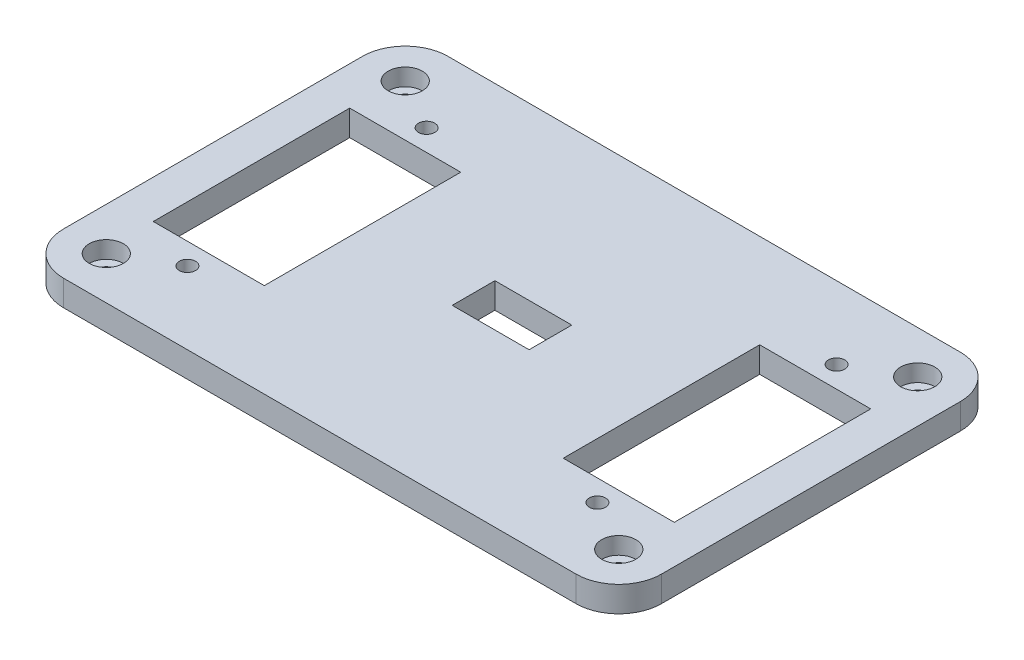
ISO-10303-21;
HEADER;
FILE_DESCRIPTION(('STEP AP214'),'2;1');
FILE_NAME('part.step','',(''),(''),'','','');
FILE_SCHEMA(('AUTOMOTIVE_DESIGN { 1 0 10303 214 1 1 1 1 }'));
ENDSEC;
DATA;
#1=APPLICATION_CONTEXT('core data for automotive mechanical design processes');
#2=APPLICATION_PROTOCOL_DEFINITION('international standard','automotive_design',2000,#1);
#3=PRODUCT_CONTEXT('',#1,'mechanical');
#4=PRODUCT('Part','Part','',(#3));
#5=PRODUCT_RELATED_PRODUCT_CATEGORY('part','',(#4));
#6=PRODUCT_DEFINITION_FORMATION('','',#4);
#7=PRODUCT_DEFINITION_CONTEXT('part definition',#1,'design');
#8=PRODUCT_DEFINITION('design','',#6,#7);
#9=PRODUCT_DEFINITION_SHAPE('','',#8);
#10=(LENGTH_UNIT() NAMED_UNIT(*) SI_UNIT(.MILLI.,.METRE.));
#11=(NAMED_UNIT(*) PLANE_ANGLE_UNIT() SI_UNIT($,.RADIAN.));
#12=(NAMED_UNIT(*) SI_UNIT($,.STERADIAN.) SOLID_ANGLE_UNIT());
#13=UNCERTAINTY_MEASURE_WITH_UNIT(LENGTH_MEASURE(1.E-05),#10,'distance_accuracy_value','');
#14=(GEOMETRIC_REPRESENTATION_CONTEXT(3) GLOBAL_UNCERTAINTY_ASSIGNED_CONTEXT((#13)) GLOBAL_UNIT_ASSIGNED_CONTEXT((#10,
#11,#12)) REPRESENTATION_CONTEXT('',''));
#15=CARTESIAN_POINT('',(0.,0.,0.));
#16=DIRECTION('',(0.,0.,1.));
#17=DIRECTION('',(1.,0.,0.));
#18=AXIS2_PLACEMENT_3D('',#15,#16,#17);
#19=CARTESIAN_POINT('',(30.,-7.,17.5));
#20=DIRECTION('',(0.,1.,0.));
#21=DIRECTION('',(0.,0.,1.));
#22=AXIS2_PLACEMENT_3D('',#19,#20,#21);
#23=CYLINDRICAL_SURFACE('',#22,0.950000000000001);
#24=CARTESIAN_POINT('',(30.,0.,17.5));
#25=DIRECTION('',(0.,1.,0.));
#26=DIRECTION('',(0.,0.,1.));
#27=AXIS2_PLACEMENT_3D('',#24,#25,#26);
#28=CIRCLE('',#27,0.950000000000001);
#29=CARTESIAN_POINT('',(30.,0.,18.45));
#30=VERTEX_POINT('',#29);
#31=EDGE_CURVE('E385',#30,#30,#28,.T.);
#32=ORIENTED_EDGE('',*,*,#31,.F.);
#33=EDGE_LOOP('',(#32));
#34=FACE_BOUND('',#33,.T.);
#35=CARTESIAN_POINT('',(30.,1.,17.5));
#36=DIRECTION('',(0.,1.,0.));
#37=DIRECTION('',(0.,0.,1.));
#38=AXIS2_PLACEMENT_3D('',#35,#36,#37);
#39=CIRCLE('',#38,0.950000000000001);
#40=CARTESIAN_POINT('',(30.,1.,18.45));
#41=VERTEX_POINT('',#40);
#42=EDGE_CURVE('E203',#41,#41,#39,.F.);
#43=ORIENTED_EDGE('',*,*,#42,.F.);
#44=EDGE_LOOP('',(#43));
#45=FACE_BOUND('',#44,.T.);
#46=ADVANCED_FACE('F34',(#34,#45),#23,.F.);
#47=CARTESIAN_POINT('',(-30.,-7.,17.5));
#48=DIRECTION('',(0.,1.,0.));
#49=DIRECTION('',(0.,0.,1.));
#50=AXIS2_PLACEMENT_3D('',#47,#48,#49);
#51=CYLINDRICAL_SURFACE('',#50,0.950000000000001);
#52=CARTESIAN_POINT('',(-30.,0.,17.5));
#53=DIRECTION('',(0.,1.,0.));
#54=DIRECTION('',(0.,0.,1.));
#55=AXIS2_PLACEMENT_3D('',#52,#53,#54);
#56=CIRCLE('',#55,0.950000000000001);
#57=CARTESIAN_POINT('',(-30.,0.,18.45));
#58=VERTEX_POINT('',#57);
#59=EDGE_CURVE('E382',#58,#58,#56,.T.);
#60=ORIENTED_EDGE('',*,*,#59,.F.);
#61=EDGE_LOOP('',(#60));
#62=FACE_BOUND('',#61,.T.);
#63=CARTESIAN_POINT('',(-30.,1.,17.5));
#64=DIRECTION('',(0.,1.,0.));
#65=DIRECTION('',(0.,0.,1.));
#66=AXIS2_PLACEMENT_3D('',#63,#64,#65);
#67=CIRCLE('',#66,0.950000000000001);
#68=CARTESIAN_POINT('',(-30.,1.,18.45));
#69=VERTEX_POINT('',#68);
#70=EDGE_CURVE('E209',#69,#69,#67,.F.);
#71=ORIENTED_EDGE('',*,*,#70,.F.);
#72=EDGE_LOOP('',(#71));
#73=FACE_BOUND('',#72,.T.);
#74=ADVANCED_FACE('F419',(#62,#73),#51,.F.);
#75=CARTESIAN_POINT('',(30.,-7.,-17.5));
#76=DIRECTION('',(0.,1.,0.));
#77=DIRECTION('',(0.,0.,1.));
#78=AXIS2_PLACEMENT_3D('',#75,#76,#77);
#79=CYLINDRICAL_SURFACE('',#78,0.950000000000001);
#80=CARTESIAN_POINT('',(30.,0.,-17.5));
#81=DIRECTION('',(0.,1.,0.));
#82=DIRECTION('',(0.,0.,1.));
#83=AXIS2_PLACEMENT_3D('',#80,#81,#82);
#84=CIRCLE('',#83,0.950000000000001);
#85=CARTESIAN_POINT('',(30.,0.,-16.55));
#86=VERTEX_POINT('',#85);
#87=EDGE_CURVE('E379',#86,#86,#84,.T.);
#88=ORIENTED_EDGE('',*,*,#87,.F.);
#89=EDGE_LOOP('',(#88));
#90=FACE_BOUND('',#89,.T.);
#91=CARTESIAN_POINT('',(30.,1.,-17.5));
#92=DIRECTION('',(0.,1.,0.));
#93=DIRECTION('',(0.,0.,1.));
#94=AXIS2_PLACEMENT_3D('',#91,#92,#93);
#95=CIRCLE('',#94,0.950000000000001);
#96=CARTESIAN_POINT('',(30.,1.,-16.55));
#97=VERTEX_POINT('',#96);
#98=EDGE_CURVE('E216',#97,#97,#95,.F.);
#99=ORIENTED_EDGE('',*,*,#98,.F.);
#100=EDGE_LOOP('',(#99));
#101=FACE_BOUND('',#100,.T.);
#102=ADVANCED_FACE('F425',(#90,#101),#79,.F.);
#103=CARTESIAN_POINT('',(-30.,-7.,-17.5));
#104=DIRECTION('',(0.,1.,0.));
#105=DIRECTION('',(0.,0.,1.));
#106=AXIS2_PLACEMENT_3D('',#103,#104,#105);
#107=CYLINDRICAL_SURFACE('',#106,0.950000000000001);
#108=CARTESIAN_POINT('',(-30.,0.,-17.5));
#109=DIRECTION('',(0.,1.,0.));
#110=DIRECTION('',(0.,0.,1.));
#111=AXIS2_PLACEMENT_3D('',#108,#109,#110);
#112=CIRCLE('',#111,0.950000000000001);
#113=CARTESIAN_POINT('',(-30.,0.,-16.55));
#114=VERTEX_POINT('',#113);
#115=EDGE_CURVE('E231',#114,#114,#112,.T.);
#116=ORIENTED_EDGE('',*,*,#115,.F.);
#117=EDGE_LOOP('',(#116));
#118=FACE_BOUND('',#117,.T.);
#119=CARTESIAN_POINT('',(-30.,1.,-17.5));
#120=DIRECTION('',(0.,1.,0.));
#121=DIRECTION('',(0.,0.,1.));
#122=AXIS2_PLACEMENT_3D('',#119,#120,#121);
#123=CIRCLE('',#122,0.950000000000001);
#124=CARTESIAN_POINT('',(-30.,1.,-16.55));
#125=VERTEX_POINT('',#124);
#126=EDGE_CURVE('E223',#125,#125,#123,.F.);
#127=ORIENTED_EDGE('',*,*,#126,.F.);
#128=EDGE_LOOP('',(#127));
#129=FACE_BOUND('',#128,.T.);
#130=ADVANCED_FACE('F436',(#118,#129),#107,.F.);
#131=CARTESIAN_POINT('',(35.,3.,-22.5));
#132=DIRECTION('',(-1.,0.,0.));
#133=DIRECTION('',(0.,0.,1.));
#134=AXIS2_PLACEMENT_3D('',#131,#132,#133);
#135=PLANE('',#134);
#136=DIRECTION('',(0.,0.,-1.));
#137=VECTOR('',#136,1.);
#138=CARTESIAN_POINT('',(35.,3.,-22.5));
#139=LINE('',#138,#137);
#140=CARTESIAN_POINT('',(35.,3.,17.5));
#141=VERTEX_POINT('',#140);
#142=CARTESIAN_POINT('',(35.,3.,-17.5));
#143=VERTEX_POINT('',#142);
#144=EDGE_CURVE('E285',#141,#143,#139,.T.);
#145=ORIENTED_EDGE('',*,*,#144,.F.);
#146=DIRECTION('',(0.,-1.,0.));
#147=VECTOR('',#146,1.);
#148=CARTESIAN_POINT('',(35.,3.,17.5));
#149=LINE('',#148,#147);
#150=CARTESIAN_POINT('',(35.,0.,17.5));
#151=VERTEX_POINT('',#150);
#152=EDGE_CURVE('E373',#141,#151,#149,.T.);
#153=ORIENTED_EDGE('',*,*,#152,.T.);
#154=DIRECTION('',(0.,0.,-1.));
#155=VECTOR('',#154,1.);
#156=CARTESIAN_POINT('',(35.,0.,-22.5));
#157=LINE('',#156,#155);
#158=CARTESIAN_POINT('',(35.,0.,-17.5));
#159=VERTEX_POINT('',#158);
#160=EDGE_CURVE('E278',#151,#159,#157,.T.);
#161=ORIENTED_EDGE('',*,*,#160,.T.);
#162=DIRECTION('',(0.,-1.,0.));
#163=VECTOR('',#162,1.);
#164=CARTESIAN_POINT('',(35.,3.,-17.5));
#165=LINE('',#164,#163);
#166=EDGE_CURVE('E344',#159,#143,#165,.F.);
#167=ORIENTED_EDGE('',*,*,#166,.T.);
#168=EDGE_LOOP('',(#145,#153,#161,#167));
#169=FACE_BOUND('',#168,.T.);
#170=ADVANCED_FACE('F440',(#169),#135,.F.);
#171=CARTESIAN_POINT('',(-35.,3.,-22.5));
#172=DIRECTION('',(0.,0.,1.));
#173=DIRECTION('',(1.,0.,0.));
#174=AXIS2_PLACEMENT_3D('',#171,#172,#173);
#175=PLANE('',#174);
#176=DIRECTION('',(-1.,0.,0.));
#177=VECTOR('',#176,1.);
#178=CARTESIAN_POINT('',(-35.,0.,-22.5));
#179=LINE('',#178,#177);
#180=CARTESIAN_POINT('',(30.,0.,-22.5));
#181=VERTEX_POINT('',#180);
#182=CARTESIAN_POINT('',(-30.,0.,-22.5));
#183=VERTEX_POINT('',#182);
#184=EDGE_CURVE('E299',#181,#183,#179,.T.);
#185=ORIENTED_EDGE('',*,*,#184,.T.);
#186=DIRECTION('',(0.,-1.,0.));
#187=VECTOR('',#186,1.);
#188=CARTESIAN_POINT('',(-30.,3.,-22.5));
#189=LINE('',#188,#187);
#190=CARTESIAN_POINT('',(-30.,3.,-22.5));
#191=VERTEX_POINT('',#190);
#192=EDGE_CURVE('E360',#183,#191,#189,.F.);
#193=ORIENTED_EDGE('',*,*,#192,.T.);
#194=DIRECTION('',(-1.,0.,0.));
#195=VECTOR('',#194,1.);
#196=CARTESIAN_POINT('',(-35.,3.,-22.5));
#197=LINE('',#196,#195);
#198=CARTESIAN_POINT('',(30.,3.,-22.5));
#199=VERTEX_POINT('',#198);
#200=EDGE_CURVE('E287',#199,#191,#197,.T.);
#201=ORIENTED_EDGE('',*,*,#200,.F.);
#202=DIRECTION('',(0.,-1.,0.));
#203=VECTOR('',#202,1.);
#204=CARTESIAN_POINT('',(30.,3.,-22.5));
#205=LINE('',#204,#203);
#206=EDGE_CURVE('E330',#199,#181,#205,.T.);
#207=ORIENTED_EDGE('',*,*,#206,.T.);
#208=EDGE_LOOP('',(#185,#193,#201,#207));
#209=FACE_BOUND('',#208,.T.);
#210=ADVANCED_FACE('F502',(#209),#175,.F.);
#211=CARTESIAN_POINT('',(-35.,3.,-22.5));
#212=DIRECTION('',(1.,0.,0.));
#213=DIRECTION('',(0.,0.,-1.));
#214=AXIS2_PLACEMENT_3D('',#211,#212,#213);
#215=PLANE('',#214);
#216=DIRECTION('',(0.,0.,1.));
#217=VECTOR('',#216,1.);
#218=CARTESIAN_POINT('',(-35.,3.,-22.5));
#219=LINE('',#218,#217);
#220=CARTESIAN_POINT('',(-35.,3.,-17.5));
#221=VERTEX_POINT('',#220);
#222=CARTESIAN_POINT('',(-35.,3.,17.5));
#223=VERTEX_POINT('',#222);
#224=EDGE_CURVE('E291',#221,#223,#219,.T.);
#225=ORIENTED_EDGE('',*,*,#224,.F.);
#226=DIRECTION('',(0.,-1.,0.));
#227=VECTOR('',#226,1.);
#228=CARTESIAN_POINT('',(-35.,3.,-17.5));
#229=LINE('',#228,#227);
#230=CARTESIAN_POINT('',(-35.,0.,-17.5));
#231=VERTEX_POINT('',#230);
#232=EDGE_CURVE('E351',#221,#231,#229,.T.);
#233=ORIENTED_EDGE('',*,*,#232,.T.);
#234=DIRECTION('',(0.,0.,1.));
#235=VECTOR('',#234,1.);
#236=CARTESIAN_POINT('',(-35.,0.,-22.5));
#237=LINE('',#236,#235);
#238=CARTESIAN_POINT('',(-35.,0.,17.5));
#239=VERTEX_POINT('',#238);
#240=EDGE_CURVE('E302',#231,#239,#237,.T.);
#241=ORIENTED_EDGE('',*,*,#240,.T.);
#242=DIRECTION('',(0.,-1.,0.));
#243=VECTOR('',#242,1.);
#244=CARTESIAN_POINT('',(-35.,3.,17.5));
#245=LINE('',#244,#243);
#246=EDGE_CURVE('E349',#239,#223,#245,.F.);
#247=ORIENTED_EDGE('',*,*,#246,.T.);
#248=EDGE_LOOP('',(#225,#233,#241,#247));
#249=FACE_BOUND('',#248,.T.);
#250=ADVANCED_FACE('F498',(#249),#215,.F.);
#251=CARTESIAN_POINT('',(-35.,3.,22.5));
#252=DIRECTION('',(0.,0.,-1.));
#253=DIRECTION('',(-1.,0.,0.));
#254=AXIS2_PLACEMENT_3D('',#251,#252,#253);
#255=PLANE('',#254);
#256=DIRECTION('',(1.,0.,0.));
#257=VECTOR('',#256,1.);
#258=CARTESIAN_POINT('',(-35.,3.,22.5));
#259=LINE('',#258,#257);
#260=CARTESIAN_POINT('',(-30.,3.,22.5));
#261=VERTEX_POINT('',#260);
#262=CARTESIAN_POINT('',(30.,3.,22.5));
#263=VERTEX_POINT('',#262);
#264=EDGE_CURVE('E294',#261,#263,#259,.T.);
#265=ORIENTED_EDGE('',*,*,#264,.F.);
#266=DIRECTION('',(0.,-1.,0.));
#267=VECTOR('',#266,1.);
#268=CARTESIAN_POINT('',(-30.,3.,22.5));
#269=LINE('',#268,#267);
#270=CARTESIAN_POINT('',(-30.,0.,22.5));
#271=VERTEX_POINT('',#270);
#272=EDGE_CURVE('E370',#261,#271,#269,.T.);
#273=ORIENTED_EDGE('',*,*,#272,.T.);
#274=DIRECTION('',(1.,0.,0.));
#275=VECTOR('',#274,1.);
#276=CARTESIAN_POINT('',(-35.,0.,22.5));
#277=LINE('',#276,#275);
#278=CARTESIAN_POINT('',(30.,0.,22.5));
#279=VERTEX_POINT('',#278);
#280=EDGE_CURVE('E288',#271,#279,#277,.T.);
#281=ORIENTED_EDGE('',*,*,#280,.T.);
#282=DIRECTION('',(0.,-1.,0.));
#283=VECTOR('',#282,1.);
#284=CARTESIAN_POINT('',(30.,3.,22.5));
#285=LINE('',#284,#283);
#286=EDGE_CURVE('E368',#279,#263,#285,.F.);
#287=ORIENTED_EDGE('',*,*,#286,.T.);
#288=EDGE_LOOP('',(#265,#273,#281,#287));
#289=FACE_BOUND('',#288,.T.);
#290=ADVANCED_FACE('F493',(#289),#255,.F.);
#291=CARTESIAN_POINT('',(0.,3.,0.));
#292=DIRECTION('',(0.,1.,0.));
#293=DIRECTION('',(0.,0.,1.));
#294=AXIS2_PLACEMENT_3D('',#291,#292,#293);
#295=PLANE('',#294);
#296=DIRECTION('',(0.,0.,-1.));
#297=VECTOR('',#296,1.);
#298=CARTESIAN_POINT('',(4.5,3.,-2.5));
#299=LINE('',#298,#297);
#300=CARTESIAN_POINT('',(4.5,3.,2.5));
#301=VERTEX_POINT('',#300);
#302=CARTESIAN_POINT('',(4.5,3.,-2.5));
#303=VERTEX_POINT('',#302);
#304=EDGE_CURVE('E49',#301,#303,#299,.T.);
#305=ORIENTED_EDGE('',*,*,#304,.F.);
#306=DIRECTION('',(1.,0.,0.));
#307=VECTOR('',#306,1.);
#308=CARTESIAN_POINT('',(-4.5,3.,2.5));
#309=LINE('',#308,#307);
#310=CARTESIAN_POINT('',(-4.5,3.,2.5));
#311=VERTEX_POINT('',#310);
#312=EDGE_CURVE('E190',#311,#301,#309,.T.);
#313=ORIENTED_EDGE('',*,*,#312,.F.);
#314=DIRECTION('',(0.,0.,1.));
#315=VECTOR('',#314,1.);
#316=CARTESIAN_POINT('',(-4.5,3.,-2.5));
#317=LINE('',#316,#315);
#318=CARTESIAN_POINT('',(-4.5,3.,-2.5));
#319=VERTEX_POINT('',#318);
#320=EDGE_CURVE('E174',#319,#311,#317,.T.);
#321=ORIENTED_EDGE('',*,*,#320,.F.);
#322=DIRECTION('',(-1.,0.,0.));
#323=VECTOR('',#322,1.);
#324=CARTESIAN_POINT('',(-4.5,3.,-2.5));
#325=LINE('',#324,#323);
#326=EDGE_CURVE('E183',#303,#319,#325,.T.);
#327=ORIENTED_EDGE('',*,*,#326,.F.);
#328=EDGE_LOOP('',(#305,#313,#321,#327));
#329=FACE_BOUND('',#328,.T.);
#330=CARTESIAN_POINT('',(30.,3.,17.5));
#331=DIRECTION('',(0.,1.,0.));
#332=DIRECTION('',(0.,0.,1.));
#333=AXIS2_PLACEMENT_3D('',#330,#331,#332);
#334=CIRCLE('',#333,2.);
#335=CARTESIAN_POINT('',(30.,3.,19.5));
#336=VERTEX_POINT('',#335);
#337=EDGE_CURVE('E197',#336,#336,#334,.T.);
#338=ORIENTED_EDGE('',*,*,#337,.F.);
#339=EDGE_LOOP('',(#338));
#340=FACE_BOUND('',#339,.T.);
#341=CARTESIAN_POINT('',(-30.,3.,17.5));
#342=DIRECTION('',(0.,1.,0.));
#343=DIRECTION('',(0.,0.,1.));
#344=AXIS2_PLACEMENT_3D('',#341,#342,#343);
#345=CIRCLE('',#344,2.);
#346=CARTESIAN_POINT('',(-30.,3.,19.5));
#347=VERTEX_POINT('',#346);
#348=EDGE_CURVE('E210',#347,#347,#345,.T.);
#349=ORIENTED_EDGE('',*,*,#348,.F.);
#350=EDGE_LOOP('',(#349));
#351=FACE_BOUND('',#350,.T.);
#352=CARTESIAN_POINT('',(30.,3.,-17.5));
#353=DIRECTION('',(0.,1.,0.));
#354=DIRECTION('',(0.,0.,1.));
#355=AXIS2_PLACEMENT_3D('',#352,#353,#354);
#356=CIRCLE('',#355,2.);
#357=CARTESIAN_POINT('',(30.,3.,-15.5));
#358=VERTEX_POINT('',#357);
#359=EDGE_CURVE('E217',#358,#358,#356,.T.);
#360=ORIENTED_EDGE('',*,*,#359,.F.);
#361=EDGE_LOOP('',(#360));
#362=FACE_BOUND('',#361,.T.);
#363=CARTESIAN_POINT('',(-30.,3.,-17.5));
#364=DIRECTION('',(0.,1.,0.));
#365=DIRECTION('',(0.,0.,1.));
#366=AXIS2_PLACEMENT_3D('',#363,#364,#365);
#367=CIRCLE('',#366,2.);
#368=CARTESIAN_POINT('',(-30.,3.,-15.5));
#369=VERTEX_POINT('',#368);
#370=EDGE_CURVE('E224',#369,#369,#367,.T.);
#371=ORIENTED_EDGE('',*,*,#370,.F.);
#372=EDGE_LOOP('',(#371));
#373=FACE_BOUND('',#372,.T.);
#374=CARTESIAN_POINT('',(24.,3.,14.));
#375=DIRECTION('',(0.,1.,0.));
#376=DIRECTION('',(0.,0.,1.));
#377=AXIS2_PLACEMENT_3D('',#374,#375,#376);
#378=CIRCLE('',#377,0.950000000000001);
#379=CARTESIAN_POINT('',(24.,3.,14.95));
#380=VERTEX_POINT('',#379);
#381=EDGE_CURVE('E227',#380,#380,#378,.T.);
#382=ORIENTED_EDGE('',*,*,#381,.F.);
#383=EDGE_LOOP('',(#382));
#384=FACE_BOUND('',#383,.T.);
#385=CARTESIAN_POINT('',(24.,3.,-14.));
#386=DIRECTION('',(0.,1.,0.));
#387=DIRECTION('',(0.,0.,1.));
#388=AXIS2_PLACEMENT_3D('',#385,#386,#387);
#389=CIRCLE('',#388,0.950000000000001);
#390=CARTESIAN_POINT('',(24.,3.,-13.05));
#391=VERTEX_POINT('',#390);
#392=EDGE_CURVE('E232',#391,#391,#389,.T.);
#393=ORIENTED_EDGE('',*,*,#392,.F.);
#394=EDGE_LOOP('',(#393));
#395=FACE_BOUND('',#394,.T.);
#396=CARTESIAN_POINT('',(-24.,3.,14.));
#397=DIRECTION('',(0.,1.,0.));
#398=DIRECTION('',(0.,0.,1.));
#399=AXIS2_PLACEMENT_3D('',#396,#397,#398);
#400=CIRCLE('',#399,0.950000000000001);
#401=CARTESIAN_POINT('',(-24.,3.,14.95));
#402=VERTEX_POINT('',#401);
#403=EDGE_CURVE('E236',#402,#402,#400,.T.);
#404=ORIENTED_EDGE('',*,*,#403,.F.);
#405=EDGE_LOOP('',(#404));
#406=FACE_BOUND('',#405,.T.);
#407=CARTESIAN_POINT('',(-24.,3.,-14.));
#408=DIRECTION('',(0.,1.,0.));
#409=DIRECTION('',(0.,0.,1.));
#410=AXIS2_PLACEMENT_3D('',#407,#408,#409);
#411=CIRCLE('',#410,0.95);
#412=CARTESIAN_POINT('',(-24.,3.,-13.05));
#413=VERTEX_POINT('',#412);
#414=EDGE_CURVE('E240',#413,#413,#411,.T.);
#415=ORIENTED_EDGE('',*,*,#414,.F.);
#416=EDGE_LOOP('',(#415));
#417=FACE_BOUND('',#416,.T.);
#418=DIRECTION('',(0.,0.,1.));
#419=VECTOR('',#418,1.);
#420=CARTESIAN_POINT('',(-30.5,3.,-11.5));
#421=LINE('',#420,#419);
#422=CARTESIAN_POINT('',(-30.5,3.,-11.5));
#423=VERTEX_POINT('',#422);
#424=CARTESIAN_POINT('',(-30.5,3.,11.5));
#425=VERTEX_POINT('',#424);
#426=EDGE_CURVE('E244',#423,#425,#421,.T.);
#427=ORIENTED_EDGE('',*,*,#426,.F.);
#428=DIRECTION('',(-1.,0.,0.));
#429=VECTOR('',#428,1.);
#430=CARTESIAN_POINT('',(-30.5,3.,-11.5));
#431=LINE('',#430,#429);
#432=CARTESIAN_POINT('',(-17.5,3.,-11.5));
#433=VERTEX_POINT('',#432);
#434=EDGE_CURVE('E252',#433,#423,#431,.T.);
#435=ORIENTED_EDGE('',*,*,#434,.F.);
#436=DIRECTION('',(0.,0.,-1.));
#437=VECTOR('',#436,1.);
#438=CARTESIAN_POINT('',(-17.5,3.,-11.5));
#439=LINE('',#438,#437);
#440=CARTESIAN_POINT('',(-17.5,3.,11.5));
#441=VERTEX_POINT('',#440);
#442=EDGE_CURVE('E249',#441,#433,#439,.T.);
#443=ORIENTED_EDGE('',*,*,#442,.F.);
#444=DIRECTION('',(1.,0.,0.));
#445=VECTOR('',#444,1.);
#446=CARTESIAN_POINT('',(-30.5,3.,11.5));
#447=LINE('',#446,#445);
#448=EDGE_CURVE('E246',#425,#441,#447,.T.);
#449=ORIENTED_EDGE('',*,*,#448,.F.);
#450=EDGE_LOOP('',(#427,#435,#443,#449));
#451=FACE_BOUND('',#450,.T.);
#452=DIRECTION('',(0.,0.,1.));
#453=VECTOR('',#452,1.);
#454=CARTESIAN_POINT('',(17.5,3.,-11.5));
#455=LINE('',#454,#453);
#456=CARTESIAN_POINT('',(17.5,3.,-11.5));
#457=VERTEX_POINT('',#456);
#458=CARTESIAN_POINT('',(17.5,3.,11.5));
#459=VERTEX_POINT('',#458);
#460=EDGE_CURVE('E258',#457,#459,#455,.T.);
#461=ORIENTED_EDGE('',*,*,#460,.F.);
#462=DIRECTION('',(-1.,0.,0.));
#463=VECTOR('',#462,1.);
#464=CARTESIAN_POINT('',(17.5,3.,-11.5));
#465=LINE('',#464,#463);
#466=CARTESIAN_POINT('',(30.5,3.,-11.5));
#467=VERTEX_POINT('',#466);
#468=EDGE_CURVE('E272',#467,#457,#465,.T.);
#469=ORIENTED_EDGE('',*,*,#468,.F.);
#470=DIRECTION('',(0.,0.,-1.));
#471=VECTOR('',#470,1.);
#472=CARTESIAN_POINT('',(30.5,3.,-11.5));
#473=LINE('',#472,#471);
#474=CARTESIAN_POINT('',(30.5,3.,11.5));
#475=VERTEX_POINT('',#474);
#476=EDGE_CURVE('E269',#475,#467,#473,.T.);
#477=ORIENTED_EDGE('',*,*,#476,.F.);
#478=DIRECTION('',(1.,0.,0.));
#479=VECTOR('',#478,1.);
#480=CARTESIAN_POINT('',(17.5,3.,11.5));
#481=LINE('',#480,#479);
#482=EDGE_CURVE('E266',#459,#475,#481,.T.);
#483=ORIENTED_EDGE('',*,*,#482,.F.);
#484=EDGE_LOOP('',(#461,#469,#477,#483));
#485=FACE_BOUND('',#484,.T.);
#486=ORIENTED_EDGE('',*,*,#200,.T.);
#487=CARTESIAN_POINT('',(-30.,3.,-17.5));
#488=DIRECTION('',(0.,1.,0.));
#489=DIRECTION('',(0.,0.,1.));
#490=AXIS2_PLACEMENT_3D('',#487,#488,#489);
#491=CIRCLE('',#490,5.);
#492=EDGE_CURVE('E366',#191,#221,#491,.T.);
#493=ORIENTED_EDGE('',*,*,#492,.T.);
#494=ORIENTED_EDGE('',*,*,#224,.T.);
#495=CARTESIAN_POINT('',(-30.,3.,17.5));
#496=DIRECTION('',(0.,1.,0.));
#497=DIRECTION('',(0.,0.,1.));
#498=AXIS2_PLACEMENT_3D('',#495,#496,#497);
#499=CIRCLE('',#498,5.);
#500=EDGE_CURVE('E364',#223,#261,#499,.T.);
#501=ORIENTED_EDGE('',*,*,#500,.T.);
#502=ORIENTED_EDGE('',*,*,#264,.T.);
#503=CARTESIAN_POINT('',(30.,3.,17.5));
#504=DIRECTION('',(0.,1.,0.));
#505=DIRECTION('',(0.,0.,1.));
#506=AXIS2_PLACEMENT_3D('',#503,#504,#505);
#507=CIRCLE('',#506,5.);
#508=EDGE_CURVE('E362',#263,#141,#507,.T.);
#509=ORIENTED_EDGE('',*,*,#508,.T.);
#510=ORIENTED_EDGE('',*,*,#144,.T.);
#511=CARTESIAN_POINT('',(30.,3.,-17.5));
#512=DIRECTION('',(0.,1.,0.));
#513=DIRECTION('',(0.,0.,1.));
#514=AXIS2_PLACEMENT_3D('',#511,#512,#513);
#515=CIRCLE('',#514,5.);
#516=EDGE_CURVE('E347',#143,#199,#515,.T.);
#517=ORIENTED_EDGE('',*,*,#516,.T.);
#518=EDGE_LOOP('',(#486,#493,#494,#501,#502,#509,#510,#517));
#519=FACE_BOUND('',#518,.T.);
#520=ADVANCED_FACE('F187',(#329,#340,#351,#362,#373,#384,#395,#406,#417,#451,#485,#519),#295,.T.);
#521=CARTESIAN_POINT('',(0.,0.,0.));
#522=DIRECTION('',(0.,1.,0.));
#523=DIRECTION('',(0.,0.,1.));
#524=AXIS2_PLACEMENT_3D('',#521,#522,#523);
#525=PLANE('',#524);
#526=DIRECTION('',(1.,0.,0.));
#527=VECTOR('',#526,1.);
#528=CARTESIAN_POINT('',(0.,0.,2.5));
#529=LINE('',#528,#527);
#530=CARTESIAN_POINT('',(-4.5,0.,2.5));
#531=VERTEX_POINT('',#530);
#532=CARTESIAN_POINT('',(4.5,0.,2.5));
#533=VERTEX_POINT('',#532);
#534=EDGE_CURVE('E42',#531,#533,#529,.T.);
#535=ORIENTED_EDGE('',*,*,#534,.T.);
#536=DIRECTION('',(0.,0.,-1.));
#537=VECTOR('',#536,1.);
#538=CARTESIAN_POINT('',(4.5,0.,0.));
#539=LINE('',#538,#537);
#540=CARTESIAN_POINT('',(4.5,0.,-2.5));
#541=VERTEX_POINT('',#540);
#542=EDGE_CURVE('E11',#533,#541,#539,.T.);
#543=ORIENTED_EDGE('',*,*,#542,.T.);
#544=DIRECTION('',(-1.,0.,0.));
#545=VECTOR('',#544,1.);
#546=CARTESIAN_POINT('',(0.,0.,-2.5));
#547=LINE('',#546,#545);
#548=CARTESIAN_POINT('',(-4.5,0.,-2.5));
#549=VERTEX_POINT('',#548);
#550=EDGE_CURVE('E376',#541,#549,#547,.T.);
#551=ORIENTED_EDGE('',*,*,#550,.T.);
#552=DIRECTION('',(0.,0.,1.));
#553=VECTOR('',#552,1.);
#554=CARTESIAN_POINT('',(-4.5,0.,0.));
#555=LINE('',#554,#553);
#556=EDGE_CURVE('E177',#549,#531,#555,.T.);
#557=ORIENTED_EDGE('',*,*,#556,.T.);
#558=EDGE_LOOP('',(#535,#543,#551,#557));
#559=FACE_BOUND('',#558,.T.);
#560=ORIENTED_EDGE('',*,*,#31,.T.);
#561=EDGE_LOOP('',(#560));
#562=FACE_BOUND('',#561,.T.);
#563=ORIENTED_EDGE('',*,*,#59,.T.);
#564=EDGE_LOOP('',(#563));
#565=FACE_BOUND('',#564,.T.);
#566=ORIENTED_EDGE('',*,*,#87,.T.);
#567=EDGE_LOOP('',(#566));
#568=FACE_BOUND('',#567,.T.);
#569=ORIENTED_EDGE('',*,*,#115,.T.);
#570=EDGE_LOOP('',(#569));
#571=FACE_BOUND('',#570,.T.);
#572=CARTESIAN_POINT('',(24.,0.,14.));
#573=DIRECTION('',(0.,1.,0.));
#574=DIRECTION('',(0.,0.,1.));
#575=AXIS2_PLACEMENT_3D('',#572,#573,#574);
#576=CIRCLE('',#575,0.950000000000001);
#577=CARTESIAN_POINT('',(24.,0.,14.95));
#578=VERTEX_POINT('',#577);
#579=EDGE_CURVE('E230',#578,#578,#576,.T.);
#580=ORIENTED_EDGE('',*,*,#579,.T.);
#581=EDGE_LOOP('',(#580));
#582=FACE_BOUND('',#581,.T.);
#583=CARTESIAN_POINT('',(24.,0.,-14.));
#584=DIRECTION('',(0.,1.,0.));
#585=DIRECTION('',(0.,0.,1.));
#586=AXIS2_PLACEMENT_3D('',#583,#584,#585);
#587=CIRCLE('',#586,0.950000000000001);
#588=CARTESIAN_POINT('',(24.,0.,-13.05));
#589=VERTEX_POINT('',#588);
#590=EDGE_CURVE('E235',#589,#589,#587,.T.);
#591=ORIENTED_EDGE('',*,*,#590,.T.);
#592=EDGE_LOOP('',(#591));
#593=FACE_BOUND('',#592,.T.);
#594=CARTESIAN_POINT('',(-24.,0.,14.));
#595=DIRECTION('',(0.,1.,0.));
#596=DIRECTION('',(0.,0.,1.));
#597=AXIS2_PLACEMENT_3D('',#594,#595,#596);
#598=CIRCLE('',#597,0.950000000000001);
#599=CARTESIAN_POINT('',(-24.,0.,14.95));
#600=VERTEX_POINT('',#599);
#601=EDGE_CURVE('E239',#600,#600,#598,.T.);
#602=ORIENTED_EDGE('',*,*,#601,.T.);
#603=EDGE_LOOP('',(#602));
#604=FACE_BOUND('',#603,.T.);
#605=CARTESIAN_POINT('',(-24.,0.,-14.));
#606=DIRECTION('',(0.,1.,0.));
#607=DIRECTION('',(0.,0.,1.));
#608=AXIS2_PLACEMENT_3D('',#605,#606,#607);
#609=CIRCLE('',#608,0.95);
#610=CARTESIAN_POINT('',(-24.,0.,-13.05));
#611=VERTEX_POINT('',#610);
#612=EDGE_CURVE('E243',#611,#611,#609,.T.);
#613=ORIENTED_EDGE('',*,*,#612,.T.);
#614=EDGE_LOOP('',(#613));
#615=FACE_BOUND('',#614,.T.);
#616=DIRECTION('',(-1.,0.,0.));
#617=VECTOR('',#616,1.);
#618=CARTESIAN_POINT('',(0.,0.,-11.5));
#619=LINE('',#618,#617);
#620=CARTESIAN_POINT('',(-17.5,0.,-11.5));
#621=VERTEX_POINT('',#620);
#622=CARTESIAN_POINT('',(-30.5,0.,-11.5));
#623=VERTEX_POINT('',#622);
#624=EDGE_CURVE('E324',#621,#623,#619,.T.);
#625=ORIENTED_EDGE('',*,*,#624,.T.);
#626=DIRECTION('',(0.,0.,1.));
#627=VECTOR('',#626,1.);
#628=CARTESIAN_POINT('',(-30.5,0.,0.));
#629=LINE('',#628,#627);
#630=CARTESIAN_POINT('',(-30.5,0.,11.5));
#631=VERTEX_POINT('',#630);
#632=EDGE_CURVE('E327',#623,#631,#629,.T.);
#633=ORIENTED_EDGE('',*,*,#632,.T.);
#634=DIRECTION('',(1.,0.,0.));
#635=VECTOR('',#634,1.);
#636=CARTESIAN_POINT('',(0.,0.,11.5));
#637=LINE('',#636,#635);
#638=CARTESIAN_POINT('',(-17.5,0.,11.5));
#639=VERTEX_POINT('',#638);
#640=EDGE_CURVE('E318',#631,#639,#637,.T.);
#641=ORIENTED_EDGE('',*,*,#640,.T.);
#642=DIRECTION('',(0.,0.,-1.));
#643=VECTOR('',#642,1.);
#644=CARTESIAN_POINT('',(-17.5,0.,0.));
#645=LINE('',#644,#643);
#646=EDGE_CURVE('E321',#639,#621,#645,.T.);
#647=ORIENTED_EDGE('',*,*,#646,.T.);
#648=EDGE_LOOP('',(#625,#633,#641,#647));
#649=FACE_BOUND('',#648,.T.);
#650=DIRECTION('',(-1.,0.,0.));
#651=VECTOR('',#650,1.);
#652=CARTESIAN_POINT('',(0.,0.,-11.5));
#653=LINE('',#652,#651);
#654=CARTESIAN_POINT('',(30.5,0.,-11.5));
#655=VERTEX_POINT('',#654);
#656=CARTESIAN_POINT('',(17.5,0.,-11.5));
#657=VERTEX_POINT('',#656);
#658=EDGE_CURVE('E312',#655,#657,#653,.T.);
#659=ORIENTED_EDGE('',*,*,#658,.T.);
#660=DIRECTION('',(0.,0.,1.));
#661=VECTOR('',#660,1.);
#662=CARTESIAN_POINT('',(17.5,0.,0.));
#663=LINE('',#662,#661);
#664=CARTESIAN_POINT('',(17.5,0.,11.5));
#665=VERTEX_POINT('',#664);
#666=EDGE_CURVE('E315',#657,#665,#663,.T.);
#667=ORIENTED_EDGE('',*,*,#666,.T.);
#668=DIRECTION('',(1.,0.,0.));
#669=VECTOR('',#668,1.);
#670=CARTESIAN_POINT('',(0.,0.,11.5));
#671=LINE('',#670,#669);
#672=CARTESIAN_POINT('',(30.5,0.,11.5));
#673=VERTEX_POINT('',#672);
#674=EDGE_CURVE('E297',#665,#673,#671,.T.);
#675=ORIENTED_EDGE('',*,*,#674,.T.);
#676=DIRECTION('',(0.,0.,-1.));
#677=VECTOR('',#676,1.);
#678=CARTESIAN_POINT('',(30.5,0.,0.));
#679=LINE('',#678,#677);
#680=EDGE_CURVE('E309',#673,#655,#679,.T.);
#681=ORIENTED_EDGE('',*,*,#680,.T.);
#682=EDGE_LOOP('',(#659,#667,#675,#681));
#683=FACE_BOUND('',#682,.T.);
#684=ORIENTED_EDGE('',*,*,#240,.F.);
#685=CARTESIAN_POINT('',(-30.,0.,-17.5));
#686=DIRECTION('',(0.,1.,0.));
#687=DIRECTION('',(0.,0.,1.));
#688=AXIS2_PLACEMENT_3D('',#685,#686,#687);
#689=CIRCLE('',#688,5.);
#690=EDGE_CURVE('E358',#231,#183,#689,.F.);
#691=ORIENTED_EDGE('',*,*,#690,.T.);
#692=ORIENTED_EDGE('',*,*,#184,.F.);
#693=CARTESIAN_POINT('',(30.,0.,-17.5));
#694=DIRECTION('',(0.,1.,0.));
#695=DIRECTION('',(0.,0.,1.));
#696=AXIS2_PLACEMENT_3D('',#693,#694,#695);
#697=CIRCLE('',#696,5.);
#698=EDGE_CURVE('E341',#181,#159,#697,.F.);
#699=ORIENTED_EDGE('',*,*,#698,.T.);
#700=ORIENTED_EDGE('',*,*,#160,.F.);
#701=CARTESIAN_POINT('',(30.,0.,17.5));
#702=DIRECTION('',(0.,1.,0.));
#703=DIRECTION('',(0.,0.,1.));
#704=AXIS2_PLACEMENT_3D('',#701,#702,#703);
#705=CIRCLE('',#704,5.);
#706=EDGE_CURVE('E354',#151,#279,#705,.F.);
#707=ORIENTED_EDGE('',*,*,#706,.T.);
#708=ORIENTED_EDGE('',*,*,#280,.F.);
#709=CARTESIAN_POINT('',(-30.,0.,17.5));
#710=DIRECTION('',(0.,1.,0.));
#711=DIRECTION('',(0.,0.,1.));
#712=AXIS2_PLACEMENT_3D('',#709,#710,#711);
#713=CIRCLE('',#712,5.);
#714=EDGE_CURVE('E356',#271,#239,#713,.F.);
#715=ORIENTED_EDGE('',*,*,#714,.T.);
#716=EDGE_LOOP('',(#684,#691,#692,#699,#700,#707,#708,#715));
#717=FACE_BOUND('',#716,.T.);
#718=ADVANCED_FACE('F399',(#559,#562,#565,#568,#571,#582,#593,#604,#615,#649,#683,#717),#525,.F.);
#719=CARTESIAN_POINT('',(17.5,-7.,-11.5));
#720=DIRECTION('',(-1.,0.,0.));
#721=DIRECTION('',(0.,0.,1.));
#722=AXIS2_PLACEMENT_3D('',#719,#720,#721);
#723=PLANE('',#722);
#724=DIRECTION('',(0.,1.,0.));
#725=VECTOR('',#724,1.);
#726=CARTESIAN_POINT('',(17.5,-7.,-11.5));
#727=LINE('',#726,#725);
#728=EDGE_CURVE('E276',#657,#457,#727,.T.);
#729=ORIENTED_EDGE('',*,*,#728,.T.);
#730=ORIENTED_EDGE('',*,*,#460,.T.);
#731=DIRECTION('',(0.,1.,0.));
#732=VECTOR('',#731,1.);
#733=CARTESIAN_POINT('',(17.5,-7.,11.5));
#734=LINE('',#733,#732);
#735=EDGE_CURVE('E275',#665,#459,#734,.T.);
#736=ORIENTED_EDGE('',*,*,#735,.F.);
#737=ORIENTED_EDGE('',*,*,#666,.F.);
#738=EDGE_LOOP('',(#729,#730,#736,#737));
#739=FACE_BOUND('',#738,.T.);
#740=ADVANCED_FACE('F480',(#739),#723,.F.);
#741=CARTESIAN_POINT('',(17.5,-7.,-11.5));
#742=DIRECTION('',(0.,0.,-1.));
#743=DIRECTION('',(-1.,0.,0.));
#744=AXIS2_PLACEMENT_3D('',#741,#742,#743);
#745=PLANE('',#744);
#746=DIRECTION('',(0.,1.,0.));
#747=VECTOR('',#746,1.);
#748=CARTESIAN_POINT('',(30.5,-7.,-11.5));
#749=LINE('',#748,#747);
#750=EDGE_CURVE('E279',#655,#467,#749,.T.);
#751=ORIENTED_EDGE('',*,*,#750,.T.);
#752=ORIENTED_EDGE('',*,*,#468,.T.);
#753=ORIENTED_EDGE('',*,*,#728,.F.);
#754=ORIENTED_EDGE('',*,*,#658,.F.);
#755=EDGE_LOOP('',(#751,#752,#753,#754));
#756=FACE_BOUND('',#755,.T.);
#757=ADVANCED_FACE('F476',(#756),#745,.F.);
#758=CARTESIAN_POINT('',(30.5,-7.,-11.5));
#759=DIRECTION('',(1.,0.,0.));
#760=DIRECTION('',(0.,0.,-1.));
#761=AXIS2_PLACEMENT_3D('',#758,#759,#760);
#762=PLANE('',#761);
#763=DIRECTION('',(0.,1.,0.));
#764=VECTOR('',#763,1.);
#765=CARTESIAN_POINT('',(30.5,-7.,11.5));
#766=LINE('',#765,#764);
#767=EDGE_CURVE('E281',#673,#475,#766,.T.);
#768=ORIENTED_EDGE('',*,*,#767,.T.);
#769=ORIENTED_EDGE('',*,*,#476,.T.);
#770=ORIENTED_EDGE('',*,*,#750,.F.);
#771=ORIENTED_EDGE('',*,*,#680,.F.);
#772=EDGE_LOOP('',(#768,#769,#770,#771));
#773=FACE_BOUND('',#772,.T.);
#774=ADVANCED_FACE('F479',(#773),#762,.F.);
#775=CARTESIAN_POINT('',(17.5,-7.,11.5));
#776=DIRECTION('',(0.,0.,1.));
#777=DIRECTION('',(1.,0.,0.));
#778=AXIS2_PLACEMENT_3D('',#775,#776,#777);
#779=PLANE('',#778);
#780=ORIENTED_EDGE('',*,*,#735,.T.);
#781=ORIENTED_EDGE('',*,*,#482,.T.);
#782=ORIENTED_EDGE('',*,*,#767,.F.);
#783=ORIENTED_EDGE('',*,*,#674,.F.);
#784=EDGE_LOOP('',(#780,#781,#782,#783));
#785=FACE_BOUND('',#784,.T.);
#786=ADVANCED_FACE('F474',(#785),#779,.F.);
#787=CARTESIAN_POINT('',(-30.5,-7.,-11.5));
#788=DIRECTION('',(-1.,0.,0.));
#789=DIRECTION('',(0.,0.,1.));
#790=AXIS2_PLACEMENT_3D('',#787,#788,#789);
#791=PLANE('',#790);
#792=DIRECTION('',(0.,1.,0.));
#793=VECTOR('',#792,1.);
#794=CARTESIAN_POINT('',(-30.5,-7.,-11.5));
#795=LINE('',#794,#793);
#796=EDGE_CURVE('E256',#623,#423,#795,.T.);
#797=ORIENTED_EDGE('',*,*,#796,.T.);
#798=ORIENTED_EDGE('',*,*,#426,.T.);
#799=DIRECTION('',(0.,1.,0.));
#800=VECTOR('',#799,1.);
#801=CARTESIAN_POINT('',(-30.5,-7.,11.5));
#802=LINE('',#801,#800);
#803=EDGE_CURVE('E255',#631,#425,#802,.T.);
#804=ORIENTED_EDGE('',*,*,#803,.F.);
#805=ORIENTED_EDGE('',*,*,#632,.F.);
#806=EDGE_LOOP('',(#797,#798,#804,#805));
#807=FACE_BOUND('',#806,.T.);
#808=ADVANCED_FACE('F464',(#807),#791,.F.);
#809=CARTESIAN_POINT('',(-30.5,-7.,-11.5));
#810=DIRECTION('',(0.,0.,-1.));
#811=DIRECTION('',(-1.,0.,0.));
#812=AXIS2_PLACEMENT_3D('',#809,#810,#811);
#813=PLANE('',#812);
#814=DIRECTION('',(0.,1.,0.));
#815=VECTOR('',#814,1.);
#816=CARTESIAN_POINT('',(-17.5,-7.,-11.5));
#817=LINE('',#816,#815);
#818=EDGE_CURVE('E259',#621,#433,#817,.T.);
#819=ORIENTED_EDGE('',*,*,#818,.T.);
#820=ORIENTED_EDGE('',*,*,#434,.T.);
#821=ORIENTED_EDGE('',*,*,#796,.F.);
#822=ORIENTED_EDGE('',*,*,#624,.F.);
#823=EDGE_LOOP('',(#819,#820,#821,#822));
#824=FACE_BOUND('',#823,.T.);
#825=ADVANCED_FACE('F460',(#824),#813,.F.);
#826=CARTESIAN_POINT('',(-17.5,-7.,-11.5));
#827=DIRECTION('',(1.,0.,0.));
#828=DIRECTION('',(0.,0.,-1.));
#829=AXIS2_PLACEMENT_3D('',#826,#827,#828);
#830=PLANE('',#829);
#831=DIRECTION('',(0.,1.,0.));
#832=VECTOR('',#831,1.);
#833=CARTESIAN_POINT('',(-17.5,-7.,11.5));
#834=LINE('',#833,#832);
#835=EDGE_CURVE('E261',#639,#441,#834,.T.);
#836=ORIENTED_EDGE('',*,*,#835,.T.);
#837=ORIENTED_EDGE('',*,*,#442,.T.);
#838=ORIENTED_EDGE('',*,*,#818,.F.);
#839=ORIENTED_EDGE('',*,*,#646,.F.);
#840=EDGE_LOOP('',(#836,#837,#838,#839));
#841=FACE_BOUND('',#840,.T.);
#842=ADVANCED_FACE('F463',(#841),#830,.F.);
#843=CARTESIAN_POINT('',(-30.5,-7.,11.5));
#844=DIRECTION('',(0.,0.,1.));
#845=DIRECTION('',(1.,0.,0.));
#846=AXIS2_PLACEMENT_3D('',#843,#844,#845);
#847=PLANE('',#846);
#848=ORIENTED_EDGE('',*,*,#803,.T.);
#849=ORIENTED_EDGE('',*,*,#448,.T.);
#850=ORIENTED_EDGE('',*,*,#835,.F.);
#851=ORIENTED_EDGE('',*,*,#640,.F.);
#852=EDGE_LOOP('',(#848,#849,#850,#851));
#853=FACE_BOUND('',#852,.T.);
#854=ADVANCED_FACE('F458',(#853),#847,.F.);
#855=CARTESIAN_POINT('',(-24.,-7.,-14.));
#856=DIRECTION('',(0.,1.,0.));
#857=DIRECTION('',(0.,0.,1.));
#858=AXIS2_PLACEMENT_3D('',#855,#856,#857);
#859=CYLINDRICAL_SURFACE('',#858,0.95);
#860=ORIENTED_EDGE('',*,*,#414,.T.);
#861=EDGE_LOOP('',(#860));
#862=FACE_BOUND('',#861,.T.);
#863=ORIENTED_EDGE('',*,*,#612,.F.);
#864=EDGE_LOOP('',(#863));
#865=FACE_BOUND('',#864,.T.);
#866=ADVANCED_FACE('F454',(#862,#865),#859,.F.);
#867=CARTESIAN_POINT('',(-24.,-7.,14.));
#868=DIRECTION('',(0.,1.,0.));
#869=DIRECTION('',(0.,0.,1.));
#870=AXIS2_PLACEMENT_3D('',#867,#868,#869);
#871=CYLINDRICAL_SURFACE('',#870,0.950000000000001);
#872=ORIENTED_EDGE('',*,*,#403,.T.);
#873=EDGE_LOOP('',(#872));
#874=FACE_BOUND('',#873,.T.);
#875=ORIENTED_EDGE('',*,*,#601,.F.);
#876=EDGE_LOOP('',(#875));
#877=FACE_BOUND('',#876,.T.);
#878=ADVANCED_FACE('F450',(#874,#877),#871,.F.);
#879=CARTESIAN_POINT('',(24.,-7.,-14.));
#880=DIRECTION('',(0.,1.,0.));
#881=DIRECTION('',(0.,0.,1.));
#882=AXIS2_PLACEMENT_3D('',#879,#880,#881);
#883=CYLINDRICAL_SURFACE('',#882,0.950000000000001);
#884=ORIENTED_EDGE('',*,*,#392,.T.);
#885=EDGE_LOOP('',(#884));
#886=FACE_BOUND('',#885,.T.);
#887=ORIENTED_EDGE('',*,*,#590,.F.);
#888=EDGE_LOOP('',(#887));
#889=FACE_BOUND('',#888,.T.);
#890=ADVANCED_FACE('F446',(#886,#889),#883,.F.);
#891=CARTESIAN_POINT('',(24.,-7.,14.));
#892=DIRECTION('',(0.,1.,0.));
#893=DIRECTION('',(0.,0.,1.));
#894=AXIS2_PLACEMENT_3D('',#891,#892,#893);
#895=CYLINDRICAL_SURFACE('',#894,0.950000000000001);
#896=ORIENTED_EDGE('',*,*,#381,.T.);
#897=EDGE_LOOP('',(#896));
#898=FACE_BOUND('',#897,.T.);
#899=ORIENTED_EDGE('',*,*,#579,.F.);
#900=EDGE_LOOP('',(#899));
#901=FACE_BOUND('',#900,.T.);
#902=ADVANCED_FACE('F442',(#898,#901),#895,.F.);
#903=CARTESIAN_POINT('',(30.,3.,-17.5));
#904=DIRECTION('',(0.,-1.,0.));
#905=DIRECTION('',(0.,0.,-1.));
#906=AXIS2_PLACEMENT_3D('',#903,#904,#905);
#907=CYLINDRICAL_SURFACE('',#906,5.);
#908=ORIENTED_EDGE('',*,*,#516,.F.);
#909=ORIENTED_EDGE('',*,*,#166,.F.);
#910=ORIENTED_EDGE('',*,*,#698,.F.);
#911=ORIENTED_EDGE('',*,*,#206,.F.);
#912=EDGE_LOOP('',(#908,#909,#910,#911));
#913=FACE_BOUND('',#912,.T.);
#914=ADVANCED_FACE('F445',(#913),#907,.T.);
#915=CARTESIAN_POINT('',(-30.,3.,-17.5));
#916=DIRECTION('',(0.,-1.,0.));
#917=DIRECTION('',(0.,0.,-1.));
#918=AXIS2_PLACEMENT_3D('',#915,#916,#917);
#919=CYLINDRICAL_SURFACE('',#918,5.);
#920=ORIENTED_EDGE('',*,*,#492,.F.);
#921=ORIENTED_EDGE('',*,*,#192,.F.);
#922=ORIENTED_EDGE('',*,*,#690,.F.);
#923=ORIENTED_EDGE('',*,*,#232,.F.);
#924=EDGE_LOOP('',(#920,#921,#922,#923));
#925=FACE_BOUND('',#924,.T.);
#926=ADVANCED_FACE('F512',(#925),#919,.T.);
#927=CARTESIAN_POINT('',(-30.,3.,17.5));
#928=DIRECTION('',(0.,-1.,0.));
#929=DIRECTION('',(0.,0.,-1.));
#930=AXIS2_PLACEMENT_3D('',#927,#928,#929);
#931=CYLINDRICAL_SURFACE('',#930,5.);
#932=ORIENTED_EDGE('',*,*,#500,.F.);
#933=ORIENTED_EDGE('',*,*,#246,.F.);
#934=ORIENTED_EDGE('',*,*,#714,.F.);
#935=ORIENTED_EDGE('',*,*,#272,.F.);
#936=EDGE_LOOP('',(#932,#933,#934,#935));
#937=FACE_BOUND('',#936,.T.);
#938=ADVANCED_FACE('F515',(#937),#931,.T.);
#939=CARTESIAN_POINT('',(30.,3.,17.5));
#940=DIRECTION('',(0.,-1.,0.));
#941=DIRECTION('',(0.,0.,-1.));
#942=AXIS2_PLACEMENT_3D('',#939,#940,#941);
#943=CYLINDRICAL_SURFACE('',#942,5.);
#944=ORIENTED_EDGE('',*,*,#508,.F.);
#945=ORIENTED_EDGE('',*,*,#286,.F.);
#946=ORIENTED_EDGE('',*,*,#706,.F.);
#947=ORIENTED_EDGE('',*,*,#152,.F.);
#948=EDGE_LOOP('',(#944,#945,#946,#947));
#949=FACE_BOUND('',#948,.T.);
#950=ADVANCED_FACE('F36',(#949),#943,.T.);
#951=CARTESIAN_POINT('',(-30.,1.,-17.5));
#952=DIRECTION('',(0.,1.,0.));
#953=DIRECTION('',(0.,0.,1.));
#954=AXIS2_PLACEMENT_3D('',#951,#952,#953);
#955=PLANE('',#954);
#956=CARTESIAN_POINT('',(-30.,1.,-17.5));
#957=DIRECTION('',(0.,1.,0.));
#958=DIRECTION('',(0.,0.,1.));
#959=AXIS2_PLACEMENT_3D('',#956,#957,#958);
#960=CIRCLE('',#959,2.);
#961=CARTESIAN_POINT('',(-30.,1.,-15.5));
#962=VERTEX_POINT('',#961);
#963=EDGE_CURVE('E220',#962,#962,#960,.T.);
#964=ORIENTED_EDGE('',*,*,#963,.T.);
#965=EDGE_LOOP('',(#964));
#966=FACE_BOUND('',#965,.T.);
#967=ORIENTED_EDGE('',*,*,#126,.T.);
#968=EDGE_LOOP('',(#967));
#969=FACE_BOUND('',#968,.T.);
#970=ADVANCED_FACE('F522',(#966,#969),#955,.T.);
#971=CARTESIAN_POINT('',(-30.,1.,-17.5));
#972=DIRECTION('',(0.,1.,0.));
#973=DIRECTION('',(0.,0.,1.));
#974=AXIS2_PLACEMENT_3D('',#971,#972,#973);
#975=CYLINDRICAL_SURFACE('',#974,2.);
#976=ORIENTED_EDGE('',*,*,#963,.F.);
#977=EDGE_LOOP('',(#976));
#978=FACE_BOUND('',#977,.T.);
#979=ORIENTED_EDGE('',*,*,#370,.T.);
#980=EDGE_LOOP('',(#979));
#981=FACE_BOUND('',#980,.T.);
#982=ADVANCED_FACE('F431',(#978,#981),#975,.F.);
#983=CARTESIAN_POINT('',(30.,1.,-17.5));
#984=DIRECTION('',(0.,1.,0.));
#985=DIRECTION('',(0.,0.,1.));
#986=AXIS2_PLACEMENT_3D('',#983,#984,#985);
#987=PLANE('',#986);
#988=CARTESIAN_POINT('',(30.,1.,-17.5));
#989=DIRECTION('',(0.,1.,0.));
#990=DIRECTION('',(0.,0.,1.));
#991=AXIS2_PLACEMENT_3D('',#988,#989,#990);
#992=CIRCLE('',#991,2.);
#993=CARTESIAN_POINT('',(30.,1.,-15.5));
#994=VERTEX_POINT('',#993);
#995=EDGE_CURVE('E213',#994,#994,#992,.T.);
#996=ORIENTED_EDGE('',*,*,#995,.T.);
#997=EDGE_LOOP('',(#996));
#998=FACE_BOUND('',#997,.T.);
#999=ORIENTED_EDGE('',*,*,#98,.T.);
#1000=EDGE_LOOP('',(#999));
#1001=FACE_BOUND('',#1000,.T.);
#1002=ADVANCED_FACE('F553',(#998,#1001),#987,.T.);
#1003=CARTESIAN_POINT('',(30.,1.,-17.5));
#1004=DIRECTION('',(0.,1.,0.));
#1005=DIRECTION('',(0.,0.,1.));
#1006=AXIS2_PLACEMENT_3D('',#1003,#1004,#1005);
#1007=CYLINDRICAL_SURFACE('',#1006,2.);
#1008=ORIENTED_EDGE('',*,*,#995,.F.);
#1009=EDGE_LOOP('',(#1008));
#1010=FACE_BOUND('',#1009,.T.);
#1011=ORIENTED_EDGE('',*,*,#359,.T.);
#1012=EDGE_LOOP('',(#1011));
#1013=FACE_BOUND('',#1012,.T.);
#1014=ADVANCED_FACE('F557',(#1010,#1013),#1007,.F.);
#1015=CARTESIAN_POINT('',(-30.,1.,17.5));
#1016=DIRECTION('',(0.,1.,0.));
#1017=DIRECTION('',(0.,0.,1.));
#1018=AXIS2_PLACEMENT_3D('',#1015,#1016,#1017);
#1019=PLANE('',#1018);
#1020=CARTESIAN_POINT('',(-30.,1.,17.5));
#1021=DIRECTION('',(0.,1.,0.));
#1022=DIRECTION('',(0.,0.,1.));
#1023=AXIS2_PLACEMENT_3D('',#1020,#1021,#1022);
#1024=CIRCLE('',#1023,2.);
#1025=CARTESIAN_POINT('',(-30.,1.,19.5));
#1026=VERTEX_POINT('',#1025);
#1027=EDGE_CURVE('E206',#1026,#1026,#1024,.T.);
#1028=ORIENTED_EDGE('',*,*,#1027,.T.);
#1029=EDGE_LOOP('',(#1028));
#1030=FACE_BOUND('',#1029,.T.);
#1031=ORIENTED_EDGE('',*,*,#70,.T.);
#1032=EDGE_LOOP('',(#1031));
#1033=FACE_BOUND('',#1032,.T.);
#1034=ADVANCED_FACE('F560',(#1030,#1033),#1019,.T.);
#1035=CARTESIAN_POINT('',(-30.,1.,17.5));
#1036=DIRECTION('',(0.,1.,0.));
#1037=DIRECTION('',(0.,0.,1.));
#1038=AXIS2_PLACEMENT_3D('',#1035,#1036,#1037);
#1039=CYLINDRICAL_SURFACE('',#1038,2.);
#1040=ORIENTED_EDGE('',*,*,#1027,.F.);
#1041=EDGE_LOOP('',(#1040));
#1042=FACE_BOUND('',#1041,.T.);
#1043=ORIENTED_EDGE('',*,*,#348,.T.);
#1044=EDGE_LOOP('',(#1043));
#1045=FACE_BOUND('',#1044,.T.);
#1046=ADVANCED_FACE('F565',(#1042,#1045),#1039,.F.);
#1047=CARTESIAN_POINT('',(30.,1.,17.5));
#1048=DIRECTION('',(0.,1.,0.));
#1049=DIRECTION('',(0.,0.,1.));
#1050=AXIS2_PLACEMENT_3D('',#1047,#1048,#1049);
#1051=PLANE('',#1050);
#1052=CARTESIAN_POINT('',(30.,1.,17.5));
#1053=DIRECTION('',(0.,1.,0.));
#1054=DIRECTION('',(0.,0.,1.));
#1055=AXIS2_PLACEMENT_3D('',#1052,#1053,#1054);
#1056=CIRCLE('',#1055,2.);
#1057=CARTESIAN_POINT('',(30.,1.,19.5));
#1058=VERTEX_POINT('',#1057);
#1059=EDGE_CURVE('E200',#1058,#1058,#1056,.T.);
#1060=ORIENTED_EDGE('',*,*,#1059,.T.);
#1061=EDGE_LOOP('',(#1060));
#1062=FACE_BOUND('',#1061,.T.);
#1063=ORIENTED_EDGE('',*,*,#42,.T.);
#1064=EDGE_LOOP('',(#1063));
#1065=FACE_BOUND('',#1064,.T.);
#1066=ADVANCED_FACE('F413',(#1062,#1065),#1051,.T.);
#1067=CARTESIAN_POINT('',(30.,1.,17.5));
#1068=DIRECTION('',(0.,1.,0.));
#1069=DIRECTION('',(0.,0.,1.));
#1070=AXIS2_PLACEMENT_3D('',#1067,#1068,#1069);
#1071=CYLINDRICAL_SURFACE('',#1070,2.);
#1072=ORIENTED_EDGE('',*,*,#1059,.F.);
#1073=EDGE_LOOP('',(#1072));
#1074=FACE_BOUND('',#1073,.T.);
#1075=ORIENTED_EDGE('',*,*,#337,.T.);
#1076=EDGE_LOOP('',(#1075));
#1077=FACE_BOUND('',#1076,.T.);
#1078=ADVANCED_FACE('F406',(#1074,#1077),#1071,.F.);
#1079=CARTESIAN_POINT('',(4.5,-11.,-2.5));
#1080=DIRECTION('',(1.,0.,0.));
#1081=DIRECTION('',(0.,0.,-1.));
#1082=AXIS2_PLACEMENT_3D('',#1079,#1080,#1081);
#1083=PLANE('',#1082);
#1084=DIRECTION('',(0.,1.,0.));
#1085=VECTOR('',#1084,1.);
#1086=CARTESIAN_POINT('',(4.5,-11.,2.5));
#1087=LINE('',#1086,#1085);
#1088=EDGE_CURVE('E195',#533,#301,#1087,.T.);
#1089=ORIENTED_EDGE('',*,*,#1088,.T.);
#1090=ORIENTED_EDGE('',*,*,#304,.T.);
#1091=DIRECTION('',(0.,1.,0.));
#1092=VECTOR('',#1091,1.);
#1093=CARTESIAN_POINT('',(4.5,-11.,-2.5));
#1094=LINE('',#1093,#1092);
#1095=EDGE_CURVE('E180',#541,#303,#1094,.T.);
#1096=ORIENTED_EDGE('',*,*,#1095,.F.);
#1097=ORIENTED_EDGE('',*,*,#542,.F.);
#1098=EDGE_LOOP('',(#1089,#1090,#1096,#1097));
#1099=FACE_BOUND('',#1098,.T.);
#1100=ADVANCED_FACE('F404',(#1099),#1083,.F.);
#1101=CARTESIAN_POINT('',(-4.5,-11.,2.5));
#1102=DIRECTION('',(0.,0.,1.));
#1103=DIRECTION('',(1.,0.,0.));
#1104=AXIS2_PLACEMENT_3D('',#1101,#1102,#1103);
#1105=PLANE('',#1104);
#1106=DIRECTION('',(0.,1.,0.));
#1107=VECTOR('',#1106,1.);
#1108=CARTESIAN_POINT('',(-4.5,-11.,2.5));
#1109=LINE('',#1108,#1107);
#1110=EDGE_CURVE('E179',#531,#311,#1109,.T.);
#1111=ORIENTED_EDGE('',*,*,#1110,.T.);
#1112=ORIENTED_EDGE('',*,*,#312,.T.);
#1113=ORIENTED_EDGE('',*,*,#1088,.F.);
#1114=ORIENTED_EDGE('',*,*,#534,.F.);
#1115=EDGE_LOOP('',(#1111,#1112,#1113,#1114));
#1116=FACE_BOUND('',#1115,.T.);
#1117=ADVANCED_FACE('F403',(#1116),#1105,.F.);
#1118=CARTESIAN_POINT('',(-4.5,-11.,-2.5));
#1119=DIRECTION('',(-1.,0.,0.));
#1120=DIRECTION('',(0.,0.,1.));
#1121=AXIS2_PLACEMENT_3D('',#1118,#1119,#1120);
#1122=PLANE('',#1121);
#1123=DIRECTION('',(0.,1.,0.));
#1124=VECTOR('',#1123,1.);
#1125=CARTESIAN_POINT('',(-4.5,-11.,-2.5));
#1126=LINE('',#1125,#1124);
#1127=EDGE_CURVE('E57',#549,#319,#1126,.T.);
#1128=ORIENTED_EDGE('',*,*,#1127,.T.);
#1129=ORIENTED_EDGE('',*,*,#320,.T.);
#1130=ORIENTED_EDGE('',*,*,#1110,.F.);
#1131=ORIENTED_EDGE('',*,*,#556,.F.);
#1132=EDGE_LOOP('',(#1128,#1129,#1130,#1131));
#1133=FACE_BOUND('',#1132,.T.);
#1134=ADVANCED_FACE('F171',(#1133),#1122,.F.);
#1135=CARTESIAN_POINT('',(-4.5,-11.,-2.5));
#1136=DIRECTION('',(0.,0.,-1.));
#1137=DIRECTION('',(-1.,0.,0.));
#1138=AXIS2_PLACEMENT_3D('',#1135,#1136,#1137);
#1139=PLANE('',#1138);
#1140=ORIENTED_EDGE('',*,*,#1095,.T.);
#1141=ORIENTED_EDGE('',*,*,#326,.T.);
#1142=ORIENTED_EDGE('',*,*,#1127,.F.);
#1143=ORIENTED_EDGE('',*,*,#550,.F.);
#1144=EDGE_LOOP('',(#1140,#1141,#1142,#1143));
#1145=FACE_BOUND('',#1144,.T.);
#1146=ADVANCED_FACE('F184',(#1145),#1139,.F.);
#1147=CLOSED_SHELL('',(#46,#74,#102,#130,#170,#210,#250,#290,#520,#718,#740,#757,#774,#786,#808,
#825,#842,#854,#866,#878,#890,#902,#914,#926,#938,#950,#970,#982,#1002,#1014,#1034,#1046,#1066,
#1078,#1100,#1117,#1134,#1146));
#1148=MANIFOLD_SOLID_BREP('B2',#1147);
#1149=ADVANCED_BREP_SHAPE_REPRESENTATION('',(#18,#1148),#14);
#1150=SHAPE_DEFINITION_REPRESENTATION(#9,#1149);
ENDSEC;
END-ISO-10303-21;
